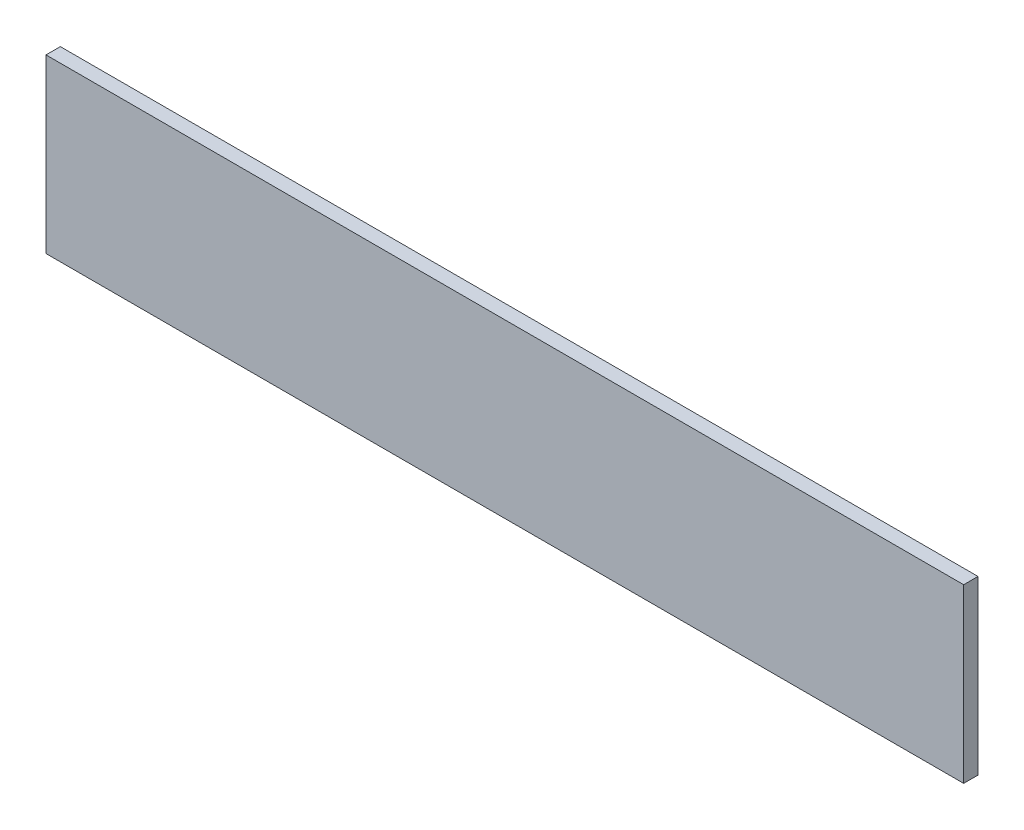
ISO-10303-21;
HEADER;
FILE_DESCRIPTION(('STEP AP214'),'2;1');
FILE_NAME('part.step','',(''),(''),'','','');
FILE_SCHEMA(('AUTOMOTIVE_DESIGN { 1 0 10303 214 1 1 1 1 }'));
ENDSEC;
DATA;
#1=APPLICATION_CONTEXT('core data for automotive mechanical design processes');
#2=APPLICATION_PROTOCOL_DEFINITION('international standard','automotive_design',2000,#1);
#3=PRODUCT_CONTEXT('',#1,'mechanical');
#4=PRODUCT('Part','Part','',(#3));
#5=PRODUCT_RELATED_PRODUCT_CATEGORY('part','',(#4));
#6=PRODUCT_DEFINITION_FORMATION('','',#4);
#7=PRODUCT_DEFINITION_CONTEXT('part definition',#1,'design');
#8=PRODUCT_DEFINITION('design','',#6,#7);
#9=PRODUCT_DEFINITION_SHAPE('','',#8);
#10=(LENGTH_UNIT() NAMED_UNIT(*) SI_UNIT(.MILLI.,.METRE.));
#11=(NAMED_UNIT(*) PLANE_ANGLE_UNIT() SI_UNIT($,.RADIAN.));
#12=(NAMED_UNIT(*) SI_UNIT($,.STERADIAN.) SOLID_ANGLE_UNIT());
#13=UNCERTAINTY_MEASURE_WITH_UNIT(LENGTH_MEASURE(1.E-05),#10,'distance_accuracy_value','');
#14=(GEOMETRIC_REPRESENTATION_CONTEXT(3) GLOBAL_UNCERTAINTY_ASSIGNED_CONTEXT((#13)) GLOBAL_UNIT_ASSIGNED_CONTEXT((#10,
#11,#12)) REPRESENTATION_CONTEXT('',''));
#15=CARTESIAN_POINT('',(0.,0.,0.));
#16=DIRECTION('',(0.,0.,1.));
#17=DIRECTION('',(1.,0.,0.));
#18=AXIS2_PLACEMENT_3D('',#15,#16,#17);
#19=CARTESIAN_POINT('',(167.891943654093,-18.6687203096186,6.35));
#20=DIRECTION('',(0.,0.,1.));
#21=DIRECTION('',(1.,0.,0.));
#22=AXIS2_PLACEMENT_3D('',#19,#20,#21);
#23=PLANE('',#22);
#24=DIRECTION('',(0.,1.,0.));
#25=VECTOR('',#24,1.);
#26=CARTESIAN_POINT('',(371.091943654092,19.4312796903814,6.35));
#27=LINE('',#26,#25);
#28=CARTESIAN_POINT('',(371.091943654092,19.4312796903814,6.35));
#29=VERTEX_POINT('',#28);
#30=CARTESIAN_POINT('',(371.091943654092,-56.7687203096186,6.35));
#31=VERTEX_POINT('',#30);
#32=EDGE_CURVE('E68',#29,#31,#27,.F.);
#33=ORIENTED_EDGE('',*,*,#32,.F.);
#34=DIRECTION('',(1.,0.,0.));
#35=VECTOR('',#34,1.);
#36=CARTESIAN_POINT('',(-35.3080563459069,19.4312796903814,6.35));
#37=LINE('',#36,#35);
#38=CARTESIAN_POINT('',(-35.3080563459069,19.4312796903814,6.35));
#39=VERTEX_POINT('',#38);
#40=EDGE_CURVE('E20',#39,#29,#37,.T.);
#41=ORIENTED_EDGE('',*,*,#40,.F.);
#42=DIRECTION('',(0.,1.,0.));
#43=VECTOR('',#42,1.);
#44=CARTESIAN_POINT('',(-35.3080563459069,-56.7687203096186,6.35));
#45=LINE('',#44,#43);
#46=CARTESIAN_POINT('',(-35.3080563459069,-56.7687203096186,6.35));
#47=VERTEX_POINT('',#46);
#48=EDGE_CURVE('E58',#47,#39,#45,.T.);
#49=ORIENTED_EDGE('',*,*,#48,.F.);
#50=DIRECTION('',(1.,0.,0.));
#51=VECTOR('',#50,1.);
#52=CARTESIAN_POINT('',(371.091943654092,-56.7687203096186,6.35));
#53=LINE('',#52,#51);
#54=EDGE_CURVE('E53',#31,#47,#53,.F.);
#55=ORIENTED_EDGE('',*,*,#54,.F.);
#56=EDGE_LOOP('',(#33,#41,#49,#55));
#57=FACE_BOUND('',#56,.T.);
#58=ADVANCED_FACE('F17',(#57),#23,.T.);
#59=CARTESIAN_POINT('',(-35.3080563459069,19.4312796903814,0.));
#60=DIRECTION('',(0.,1.,0.));
#61=DIRECTION('',(0.,0.,1.));
#62=AXIS2_PLACEMENT_3D('',#59,#60,#61);
#63=PLANE('',#62);
#64=ORIENTED_EDGE('',*,*,#40,.T.);
#65=DIRECTION('',(0.,0.,-1.));
#66=VECTOR('',#65,1.);
#67=CARTESIAN_POINT('',(371.091943654092,19.4312796903814,0.));
#68=LINE('',#67,#66);
#69=CARTESIAN_POINT('',(371.091943654092,19.4312796903814,0.));
#70=VERTEX_POINT('',#69);
#71=EDGE_CURVE('E79',#70,#29,#68,.F.);
#72=ORIENTED_EDGE('',*,*,#71,.F.);
#73=DIRECTION('',(1.,0.,0.));
#74=VECTOR('',#73,1.);
#75=CARTESIAN_POINT('',(167.891943654093,19.4312796903814,0.));
#76=LINE('',#75,#74);
#77=CARTESIAN_POINT('',(-35.3080563459069,19.4312796903814,0.));
#78=VERTEX_POINT('',#77);
#79=EDGE_CURVE('E74',#70,#78,#76,.F.);
#80=ORIENTED_EDGE('',*,*,#79,.T.);
#81=DIRECTION('',(0.,0.,1.));
#82=VECTOR('',#81,1.);
#83=CARTESIAN_POINT('',(-35.3080563459069,19.4312796903814,0.));
#84=LINE('',#83,#82);
#85=EDGE_CURVE('E63',#39,#78,#84,.F.);
#86=ORIENTED_EDGE('',*,*,#85,.F.);
#87=EDGE_LOOP('',(#64,#72,#80,#86));
#88=FACE_BOUND('',#87,.T.);
#89=ADVANCED_FACE('F73',(#88),#63,.T.);
#90=CARTESIAN_POINT('',(-35.3080563459069,-56.7687203096186,0.));
#91=DIRECTION('',(-1.,0.,0.));
#92=DIRECTION('',(0.,0.,1.));
#93=AXIS2_PLACEMENT_3D('',#90,#91,#92);
#94=PLANE('',#93);
#95=ORIENTED_EDGE('',*,*,#48,.T.);
#96=ORIENTED_EDGE('',*,*,#85,.T.);
#97=DIRECTION('',(0.,1.,0.));
#98=VECTOR('',#97,1.);
#99=CARTESIAN_POINT('',(-35.3080563459069,-18.6687203096186,0.));
#100=LINE('',#99,#98);
#101=CARTESIAN_POINT('',(-35.3080563459069,-56.7687203096186,0.));
#102=VERTEX_POINT('',#101);
#103=EDGE_CURVE('E84',#78,#102,#100,.F.);
#104=ORIENTED_EDGE('',*,*,#103,.T.);
#105=DIRECTION('',(0.,0.,-1.));
#106=VECTOR('',#105,1.);
#107=CARTESIAN_POINT('',(-35.3080563459068,-56.7687203096186,0.));
#108=LINE('',#107,#106);
#109=EDGE_CURVE('E65',#47,#102,#108,.T.);
#110=ORIENTED_EDGE('',*,*,#109,.F.);
#111=EDGE_LOOP('',(#95,#96,#104,#110));
#112=FACE_BOUND('',#111,.T.);
#113=ADVANCED_FACE('F60',(#112),#94,.T.);
#114=CARTESIAN_POINT('',(371.091943654092,-56.7687203096186,0.));
#115=DIRECTION('',(0.,-1.,0.));
#116=DIRECTION('',(0.,0.,-1.));
#117=AXIS2_PLACEMENT_3D('',#114,#115,#116);
#118=PLANE('',#117);
#119=ORIENTED_EDGE('',*,*,#54,.T.);
#120=ORIENTED_EDGE('',*,*,#109,.T.);
#121=DIRECTION('',(1.,0.,0.));
#122=VECTOR('',#121,1.);
#123=CARTESIAN_POINT('',(167.891943654093,-56.7687203096186,0.));
#124=LINE('',#123,#122);
#125=CARTESIAN_POINT('',(371.091943654092,-56.7687203096186,0.));
#126=VERTEX_POINT('',#125);
#127=EDGE_CURVE('E26',#102,#126,#124,.T.);
#128=ORIENTED_EDGE('',*,*,#127,.T.);
#129=DIRECTION('',(0.,0.,-1.));
#130=VECTOR('',#129,1.);
#131=CARTESIAN_POINT('',(371.091943654092,-56.7687203096186,0.));
#132=LINE('',#131,#130);
#133=EDGE_CURVE('E34',#31,#126,#132,.T.);
#134=ORIENTED_EDGE('',*,*,#133,.F.);
#135=EDGE_LOOP('',(#119,#120,#128,#134));
#136=FACE_BOUND('',#135,.T.);
#137=ADVANCED_FACE('F88',(#136),#118,.T.);
#138=CARTESIAN_POINT('',(371.091943654092,19.4312796903814,0.));
#139=DIRECTION('',(1.,0.,0.));
#140=DIRECTION('',(0.,0.,-1.));
#141=AXIS2_PLACEMENT_3D('',#138,#139,#140);
#142=PLANE('',#141);
#143=ORIENTED_EDGE('',*,*,#32,.T.);
#144=ORIENTED_EDGE('',*,*,#133,.T.);
#145=DIRECTION('',(0.,1.,0.));
#146=VECTOR('',#145,1.);
#147=CARTESIAN_POINT('',(371.091943654092,-18.6687203096186,0.));
#148=LINE('',#147,#146);
#149=EDGE_CURVE('E11',#126,#70,#148,.T.);
#150=ORIENTED_EDGE('',*,*,#149,.T.);
#151=ORIENTED_EDGE('',*,*,#71,.T.);
#152=EDGE_LOOP('',(#143,#144,#150,#151));
#153=FACE_BOUND('',#152,.T.);
#154=ADVANCED_FACE('F91',(#153),#142,.T.);
#155=CARTESIAN_POINT('',(167.891943654093,-18.6687203096186,0.));
#156=DIRECTION('',(0.,0.,1.));
#157=DIRECTION('',(1.,0.,0.));
#158=AXIS2_PLACEMENT_3D('',#155,#156,#157);
#159=PLANE('',#158);
#160=ORIENTED_EDGE('',*,*,#127,.F.);
#161=ORIENTED_EDGE('',*,*,#103,.F.);
#162=ORIENTED_EDGE('',*,*,#79,.F.);
#163=ORIENTED_EDGE('',*,*,#149,.F.);
#164=EDGE_LOOP('',(#160,#161,#162,#163));
#165=FACE_BOUND('',#164,.T.);
#166=ADVANCED_FACE('F90',(#165),#159,.F.);
#167=CLOSED_SHELL('',(#58,#89,#113,#137,#154,#166));
#168=MANIFOLD_SOLID_BREP('B1',#167);
#169=ADVANCED_BREP_SHAPE_REPRESENTATION('',(#18,#168),#14);
#170=SHAPE_DEFINITION_REPRESENTATION(#9,#169);
ENDSEC;
END-ISO-10303-21;
